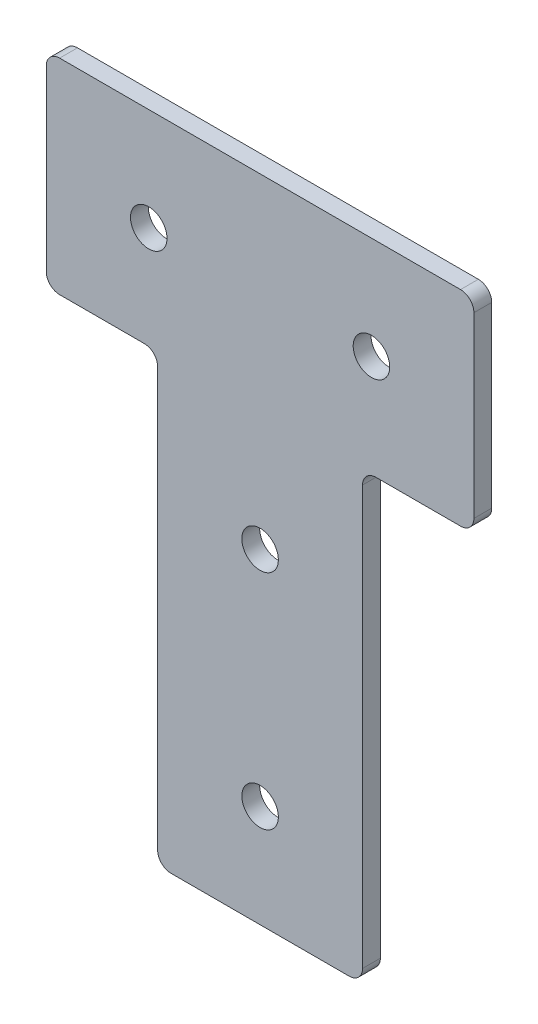
ISO-10303-21;
HEADER;
FILE_DESCRIPTION(('STEP AP214'),'2;1');
FILE_NAME('part.step','',(''),(''),'','','');
FILE_SCHEMA(('AUTOMOTIVE_DESIGN { 1 0 10303 214 1 1 1 1 }'));
ENDSEC;
DATA;
#1=APPLICATION_CONTEXT('core data for automotive mechanical design processes');
#2=APPLICATION_PROTOCOL_DEFINITION('international standard','automotive_design',2000,#1);
#3=PRODUCT_CONTEXT('',#1,'mechanical');
#4=PRODUCT('Part','Part','',(#3));
#5=PRODUCT_RELATED_PRODUCT_CATEGORY('part','',(#4));
#6=PRODUCT_DEFINITION_FORMATION('','',#4);
#7=PRODUCT_DEFINITION_CONTEXT('part definition',#1,'design');
#8=PRODUCT_DEFINITION('design','',#6,#7);
#9=PRODUCT_DEFINITION_SHAPE('','',#8);
#10=(LENGTH_UNIT() NAMED_UNIT(*) SI_UNIT(.MILLI.,.METRE.));
#11=(NAMED_UNIT(*) PLANE_ANGLE_UNIT() SI_UNIT($,.RADIAN.));
#12=(NAMED_UNIT(*) SI_UNIT($,.STERADIAN.) SOLID_ANGLE_UNIT());
#13=UNCERTAINTY_MEASURE_WITH_UNIT(LENGTH_MEASURE(1.E-05),#10,'distance_accuracy_value','');
#14=(GEOMETRIC_REPRESENTATION_CONTEXT(3) GLOBAL_UNCERTAINTY_ASSIGNED_CONTEXT((#13)) GLOBAL_UNIT_ASSIGNED_CONTEXT((#10,
#11,#12)) REPRESENTATION_CONTEXT('',''));
#15=CARTESIAN_POINT('',(0.,0.,0.));
#16=DIRECTION('',(0.,0.,1.));
#17=DIRECTION('',(1.,0.,0.));
#18=AXIS2_PLACEMENT_3D('',#15,#16,#17);
#19=CARTESIAN_POINT('',(0.,0.,4.));
#20=DIRECTION('',(0.,0.,1.));
#21=DIRECTION('',(1.,0.,0.));
#22=AXIS2_PLACEMENT_3D('',#19,#20,#21);
#23=PLANE('',#22);
#24=CARTESIAN_POINT('',(25.0000000000005,-99.9999999999999,4.));
#25=DIRECTION('',(0.,0.,1.));
#26=DIRECTION('',(1.,0.,0.));
#27=AXIS2_PLACEMENT_3D('',#24,#25,#26);
#28=CIRCLE('',#27,4.10000000000001);
#29=CARTESIAN_POINT('',(29.1000000000005,-99.9999999999999,4.));
#30=VERTEX_POINT('',#29);
#31=EDGE_CURVE('E341',#30,#30,#28,.T.);
#32=ORIENTED_EDGE('',*,*,#31,.F.);
#33=EDGE_LOOP('',(#32));
#34=FACE_BOUND('',#33,.T.);
#35=CARTESIAN_POINT('',(0.,0.,4.));
#36=DIRECTION('',(0.,0.,1.));
#37=DIRECTION('',(1.,0.,0.));
#38=AXIS2_PLACEMENT_3D('',#35,#36,#37);
#39=CIRCLE('',#38,4.1);
#40=CARTESIAN_POINT('',(4.1,0.,4.));
#41=VERTEX_POINT('',#40);
#42=EDGE_CURVE('E267',#41,#41,#39,.T.);
#43=ORIENTED_EDGE('',*,*,#42,.F.);
#44=EDGE_LOOP('',(#43));
#45=FACE_BOUND('',#44,.T.);
#46=DIRECTION('',(-1.,0.,0.));
#47=VECTOR('',#46,1.);
#48=CARTESIAN_POINT('',(-23.,23.,4.));
#49=LINE('',#48,#47);
#50=CARTESIAN_POINT('',(70.,23.,4.));
#51=VERTEX_POINT('',#50);
#52=CARTESIAN_POINT('',(-20.,23.,4.));
#53=VERTEX_POINT('',#52);
#54=EDGE_CURVE('E169',#51,#53,#49,.T.);
#55=ORIENTED_EDGE('',*,*,#54,.T.);
#56=CARTESIAN_POINT('',(-20.,20.,4.));
#57=DIRECTION('',(0.,0.,1.));
#58=DIRECTION('',(1.,0.,0.));
#59=AXIS2_PLACEMENT_3D('',#56,#57,#58);
#60=CIRCLE('',#59,3.);
#61=CARTESIAN_POINT('',(-23.,20.,4.));
#62=VERTEX_POINT('',#61);
#63=EDGE_CURVE('E214',#53,#62,#60,.T.);
#64=ORIENTED_EDGE('',*,*,#63,.T.);
#65=DIRECTION('',(0.,-1.,0.));
#66=VECTOR('',#65,1.);
#67=CARTESIAN_POINT('',(-23.,23.,4.));
#68=LINE('',#67,#66);
#69=CARTESIAN_POINT('',(-23.,-20.,4.));
#70=VERTEX_POINT('',#69);
#71=EDGE_CURVE('E168',#62,#70,#68,.T.);
#72=ORIENTED_EDGE('',*,*,#71,.T.);
#73=CARTESIAN_POINT('',(-20.,-20.,4.));
#74=DIRECTION('',(0.,0.,1.));
#75=DIRECTION('',(1.,0.,0.));
#76=AXIS2_PLACEMENT_3D('',#73,#74,#75);
#77=CIRCLE('',#76,3.);
#78=CARTESIAN_POINT('',(-20.,-23.,4.));
#79=VERTEX_POINT('',#78);
#80=EDGE_CURVE('E205',#70,#79,#77,.T.);
#81=ORIENTED_EDGE('',*,*,#80,.T.);
#82=DIRECTION('',(1.,0.,0.));
#83=VECTOR('',#82,1.);
#84=CARTESIAN_POINT('',(-23.,-23.,4.));
#85=LINE('',#84,#83);
#86=CARTESIAN_POINT('',(-1.,-23.,4.));
#87=VERTEX_POINT('',#86);
#88=EDGE_CURVE('E248',#79,#87,#85,.T.);
#89=ORIENTED_EDGE('',*,*,#88,.T.);
#90=CARTESIAN_POINT('',(-1.,-26.,4.));
#91=DIRECTION('',(0.,0.,1.));
#92=DIRECTION('',(1.,0.,0.));
#93=AXIS2_PLACEMENT_3D('',#90,#91,#92);
#94=CIRCLE('',#93,3.);
#95=CARTESIAN_POINT('',(2.,-26.,4.));
#96=VERTEX_POINT('',#95);
#97=EDGE_CURVE('E9',#87,#96,#94,.F.);
#98=ORIENTED_EDGE('',*,*,#97,.T.);
#99=DIRECTION('',(0.,-1.,0.));
#100=VECTOR('',#99,1.);
#101=CARTESIAN_POINT('',(2.,-23.,4.));
#102=LINE('',#101,#100);
#103=CARTESIAN_POINT('',(2.00000000000001,-120.,4.));
#104=VERTEX_POINT('',#103);
#105=EDGE_CURVE('E246',#96,#104,#102,.T.);
#106=ORIENTED_EDGE('',*,*,#105,.T.);
#107=CARTESIAN_POINT('',(5.00000000000001,-120.,4.));
#108=DIRECTION('',(0.,0.,1.));
#109=DIRECTION('',(1.,0.,0.));
#110=AXIS2_PLACEMENT_3D('',#107,#108,#109);
#111=CIRCLE('',#110,3.);
#112=CARTESIAN_POINT('',(5.00000000000001,-123.,4.));
#113=VERTEX_POINT('',#112);
#114=EDGE_CURVE('E210',#104,#113,#111,.T.);
#115=ORIENTED_EDGE('',*,*,#114,.T.);
#116=DIRECTION('',(1.,0.,0.));
#117=VECTOR('',#116,1.);
#118=CARTESIAN_POINT('',(2.00000000000001,-123.,4.));
#119=LINE('',#118,#117);
#120=CARTESIAN_POINT('',(45.,-123.,4.));
#121=VERTEX_POINT('',#120);
#122=EDGE_CURVE('E252',#113,#121,#119,.T.);
#123=ORIENTED_EDGE('',*,*,#122,.T.);
#124=CARTESIAN_POINT('',(45.,-120.,4.));
#125=DIRECTION('',(0.,0.,1.));
#126=DIRECTION('',(1.,0.,0.));
#127=AXIS2_PLACEMENT_3D('',#124,#125,#126);
#128=CIRCLE('',#127,3.);
#129=CARTESIAN_POINT('',(48.,-120.,4.));
#130=VERTEX_POINT('',#129);
#131=EDGE_CURVE('E208',#121,#130,#128,.T.);
#132=ORIENTED_EDGE('',*,*,#131,.T.);
#133=DIRECTION('',(0.,1.,0.));
#134=VECTOR('',#133,1.);
#135=CARTESIAN_POINT('',(48.,-23.,4.));
#136=LINE('',#135,#134);
#137=CARTESIAN_POINT('',(48.,-26.,4.));
#138=VERTEX_POINT('',#137);
#139=EDGE_CURVE('E255',#130,#138,#136,.T.);
#140=ORIENTED_EDGE('',*,*,#139,.T.);
#141=CARTESIAN_POINT('',(51.,-26.,4.));
#142=DIRECTION('',(0.,0.,1.));
#143=DIRECTION('',(1.,0.,0.));
#144=AXIS2_PLACEMENT_3D('',#141,#142,#143);
#145=CIRCLE('',#144,3.);
#146=CARTESIAN_POINT('',(51.,-23.,4.));
#147=VERTEX_POINT('',#146);
#148=EDGE_CURVE('E139',#138,#147,#145,.F.);
#149=ORIENTED_EDGE('',*,*,#148,.T.);
#150=DIRECTION('',(1.,0.,0.));
#151=VECTOR('',#150,1.);
#152=CARTESIAN_POINT('',(48.,-23.,4.));
#153=LINE('',#152,#151);
#154=CARTESIAN_POINT('',(70.,-23.,4.));
#155=VERTEX_POINT('',#154);
#156=EDGE_CURVE('E148',#147,#155,#153,.T.);
#157=ORIENTED_EDGE('',*,*,#156,.T.);
#158=CARTESIAN_POINT('',(70.,-20.,4.));
#159=DIRECTION('',(0.,0.,1.));
#160=DIRECTION('',(1.,0.,0.));
#161=AXIS2_PLACEMENT_3D('',#158,#159,#160);
#162=CIRCLE('',#161,3.);
#163=CARTESIAN_POINT('',(73.,-20.,4.));
#164=VERTEX_POINT('',#163);
#165=EDGE_CURVE('E37',#155,#164,#162,.T.);
#166=ORIENTED_EDGE('',*,*,#165,.T.);
#167=DIRECTION('',(0.,1.,0.));
#168=VECTOR('',#167,1.);
#169=CARTESIAN_POINT('',(73.,23.,4.));
#170=LINE('',#169,#168);
#171=CARTESIAN_POINT('',(73.,20.,4.));
#172=VERTEX_POINT('',#171);
#173=EDGE_CURVE('E263',#164,#172,#170,.T.);
#174=ORIENTED_EDGE('',*,*,#173,.T.);
#175=CARTESIAN_POINT('',(70.,20.,4.));
#176=DIRECTION('',(0.,0.,1.));
#177=DIRECTION('',(1.,0.,0.));
#178=AXIS2_PLACEMENT_3D('',#175,#176,#177);
#179=CIRCLE('',#178,3.);
#180=EDGE_CURVE('E212',#172,#51,#179,.T.);
#181=ORIENTED_EDGE('',*,*,#180,.T.);
#182=EDGE_LOOP('',(#55,#64,#72,#81,#89,#98,#106,#115,#123,#132,#140,#149,#157,#166,#174,#181));
#183=FACE_BOUND('',#182,.T.);
#184=CARTESIAN_POINT('',(50.,0.,4.));
#185=DIRECTION('',(0.,0.,1.));
#186=DIRECTION('',(1.,0.,0.));
#187=AXIS2_PLACEMENT_3D('',#184,#185,#186);
#188=CIRCLE('',#187,4.09999999999999);
#189=CARTESIAN_POINT('',(54.1,0.,4.));
#190=VERTEX_POINT('',#189);
#191=EDGE_CURVE('E335',#190,#190,#188,.T.);
#192=ORIENTED_EDGE('',*,*,#191,.F.);
#193=EDGE_LOOP('',(#192));
#194=FACE_BOUND('',#193,.T.);
#195=CARTESIAN_POINT('',(25.,-50.,4.));
#196=DIRECTION('',(0.,0.,1.));
#197=DIRECTION('',(1.,0.,0.));
#198=AXIS2_PLACEMENT_3D('',#195,#196,#197);
#199=CIRCLE('',#198,4.1);
#200=CARTESIAN_POINT('',(29.1,-50.,4.));
#201=VERTEX_POINT('',#200);
#202=EDGE_CURVE('E347',#201,#201,#199,.T.);
#203=ORIENTED_EDGE('',*,*,#202,.F.);
#204=EDGE_LOOP('',(#203));
#205=FACE_BOUND('',#204,.T.);
#206=ADVANCED_FACE('F15',(#34,#45,#183,#194,#205),#23,.T.);
#207=CARTESIAN_POINT('',(0.,0.,0.));
#208=DIRECTION('',(0.,0.,1.));
#209=DIRECTION('',(1.,0.,0.));
#210=AXIS2_PLACEMENT_3D('',#207,#208,#209);
#211=PLANE('',#210);
#212=DIRECTION('',(0.,-1.,0.));
#213=VECTOR('',#212,1.);
#214=CARTESIAN_POINT('',(-23.,23.,0.));
#215=LINE('',#214,#213);
#216=CARTESIAN_POINT('',(-23.,20.,0.));
#217=VERTEX_POINT('',#216);
#218=CARTESIAN_POINT('',(-23.,-20.,0.));
#219=VERTEX_POINT('',#218);
#220=EDGE_CURVE('E238',#217,#219,#215,.T.);
#221=ORIENTED_EDGE('',*,*,#220,.F.);
#222=CARTESIAN_POINT('',(-20.,20.,0.));
#223=DIRECTION('',(0.,0.,1.));
#224=DIRECTION('',(1.,0.,0.));
#225=AXIS2_PLACEMENT_3D('',#222,#223,#224);
#226=CIRCLE('',#225,3.);
#227=CARTESIAN_POINT('',(-20.,23.,0.));
#228=VERTEX_POINT('',#227);
#229=EDGE_CURVE('E198',#217,#228,#226,.F.);
#230=ORIENTED_EDGE('',*,*,#229,.T.);
#231=DIRECTION('',(-1.,0.,0.));
#232=VECTOR('',#231,1.);
#233=CARTESIAN_POINT('',(-23.,23.,0.));
#234=LINE('',#233,#232);
#235=CARTESIAN_POINT('',(70.,23.,0.));
#236=VERTEX_POINT('',#235);
#237=EDGE_CURVE('E160',#236,#228,#234,.T.);
#238=ORIENTED_EDGE('',*,*,#237,.F.);
#239=CARTESIAN_POINT('',(70.,20.,0.));
#240=DIRECTION('',(0.,0.,1.));
#241=DIRECTION('',(1.,0.,0.));
#242=AXIS2_PLACEMENT_3D('',#239,#240,#241);
#243=CIRCLE('',#242,3.);
#244=CARTESIAN_POINT('',(73.,20.,0.));
#245=VERTEX_POINT('',#244);
#246=EDGE_CURVE('E196',#236,#245,#243,.F.);
#247=ORIENTED_EDGE('',*,*,#246,.T.);
#248=DIRECTION('',(0.,1.,0.));
#249=VECTOR('',#248,1.);
#250=CARTESIAN_POINT('',(73.,23.,0.));
#251=LINE('',#250,#249);
#252=CARTESIAN_POINT('',(73.,-20.,0.));
#253=VERTEX_POINT('',#252);
#254=EDGE_CURVE('E157',#253,#245,#251,.T.);
#255=ORIENTED_EDGE('',*,*,#254,.F.);
#256=CARTESIAN_POINT('',(70.,-20.,0.));
#257=DIRECTION('',(0.,0.,1.));
#258=DIRECTION('',(1.,0.,0.));
#259=AXIS2_PLACEMENT_3D('',#256,#257,#258);
#260=CIRCLE('',#259,3.);
#261=CARTESIAN_POINT('',(70.,-23.,0.));
#262=VERTEX_POINT('',#261);
#263=EDGE_CURVE('E156',#253,#262,#260,.F.);
#264=ORIENTED_EDGE('',*,*,#263,.T.);
#265=DIRECTION('',(1.,0.,0.));
#266=VECTOR('',#265,1.);
#267=CARTESIAN_POINT('',(48.,-23.,0.));
#268=LINE('',#267,#266);
#269=CARTESIAN_POINT('',(51.,-23.,0.));
#270=VERTEX_POINT('',#269);
#271=EDGE_CURVE('E146',#270,#262,#268,.T.);
#272=ORIENTED_EDGE('',*,*,#271,.F.);
#273=CARTESIAN_POINT('',(51.,-26.,0.));
#274=DIRECTION('',(0.,0.,1.));
#275=DIRECTION('',(1.,0.,0.));
#276=AXIS2_PLACEMENT_3D('',#273,#274,#275);
#277=CIRCLE('',#276,3.);
#278=CARTESIAN_POINT('',(48.,-26.,0.));
#279=VERTEX_POINT('',#278);
#280=EDGE_CURVE('E129',#270,#279,#277,.T.);
#281=ORIENTED_EDGE('',*,*,#280,.T.);
#282=DIRECTION('',(0.,1.,0.));
#283=VECTOR('',#282,1.);
#284=CARTESIAN_POINT('',(48.,-23.,0.));
#285=LINE('',#284,#283);
#286=CARTESIAN_POINT('',(48.,-120.,0.));
#287=VERTEX_POINT('',#286);
#288=EDGE_CURVE('E158',#287,#279,#285,.T.);
#289=ORIENTED_EDGE('',*,*,#288,.F.);
#290=CARTESIAN_POINT('',(45.,-120.,0.));
#291=DIRECTION('',(0.,0.,1.));
#292=DIRECTION('',(1.,0.,0.));
#293=AXIS2_PLACEMENT_3D('',#290,#291,#292);
#294=CIRCLE('',#293,3.);
#295=CARTESIAN_POINT('',(45.,-123.,0.));
#296=VERTEX_POINT('',#295);
#297=EDGE_CURVE('E192',#287,#296,#294,.F.);
#298=ORIENTED_EDGE('',*,*,#297,.T.);
#299=DIRECTION('',(1.,0.,0.));
#300=VECTOR('',#299,1.);
#301=CARTESIAN_POINT('',(2.00000000000001,-123.,0.));
#302=LINE('',#301,#300);
#303=CARTESIAN_POINT('',(5.00000000000001,-123.,0.));
#304=VERTEX_POINT('',#303);
#305=EDGE_CURVE('E162',#304,#296,#302,.T.);
#306=ORIENTED_EDGE('',*,*,#305,.F.);
#307=CARTESIAN_POINT('',(5.00000000000001,-120.,0.));
#308=DIRECTION('',(0.,0.,1.));
#309=DIRECTION('',(1.,0.,0.));
#310=AXIS2_PLACEMENT_3D('',#307,#308,#309);
#311=CIRCLE('',#310,3.);
#312=CARTESIAN_POINT('',(2.00000000000001,-120.,0.));
#313=VERTEX_POINT('',#312);
#314=EDGE_CURVE('E194',#304,#313,#311,.F.);
#315=ORIENTED_EDGE('',*,*,#314,.T.);
#316=DIRECTION('',(0.,-1.,0.));
#317=VECTOR('',#316,1.);
#318=CARTESIAN_POINT('',(2.,-23.,0.));
#319=LINE('',#318,#317);
#320=CARTESIAN_POINT('',(2.,-26.,0.));
#321=VERTEX_POINT('',#320);
#322=EDGE_CURVE('E229',#321,#313,#319,.T.);
#323=ORIENTED_EDGE('',*,*,#322,.F.);
#324=CARTESIAN_POINT('',(-1.,-26.,0.));
#325=DIRECTION('',(0.,0.,1.));
#326=DIRECTION('',(1.,0.,0.));
#327=AXIS2_PLACEMENT_3D('',#324,#325,#326);
#328=CIRCLE('',#327,3.);
#329=CARTESIAN_POINT('',(-1.,-23.,0.));
#330=VERTEX_POINT('',#329);
#331=EDGE_CURVE('E23',#321,#330,#328,.T.);
#332=ORIENTED_EDGE('',*,*,#331,.T.);
#333=DIRECTION('',(1.,0.,0.));
#334=VECTOR('',#333,1.);
#335=CARTESIAN_POINT('',(-23.,-23.,0.));
#336=LINE('',#335,#334);
#337=CARTESIAN_POINT('',(-20.,-23.,0.));
#338=VERTEX_POINT('',#337);
#339=EDGE_CURVE('E227',#338,#330,#336,.T.);
#340=ORIENTED_EDGE('',*,*,#339,.F.);
#341=CARTESIAN_POINT('',(-20.,-20.,0.));
#342=DIRECTION('',(0.,0.,1.));
#343=DIRECTION('',(1.,0.,0.));
#344=AXIS2_PLACEMENT_3D('',#341,#342,#343);
#345=CIRCLE('',#344,3.);
#346=EDGE_CURVE('E189',#338,#219,#345,.F.);
#347=ORIENTED_EDGE('',*,*,#346,.T.);
#348=EDGE_LOOP('',(#221,#230,#238,#247,#255,#264,#272,#281,#289,#298,#306,#315,#323,#332,#340,#347));
#349=FACE_BOUND('',#348,.T.);
#350=CARTESIAN_POINT('',(0.,0.,0.));
#351=DIRECTION('',(0.,0.,1.));
#352=DIRECTION('',(1.,0.,0.));
#353=AXIS2_PLACEMENT_3D('',#350,#351,#352);
#354=CIRCLE('',#353,4.1);
#355=CARTESIAN_POINT('',(4.1,0.,0.));
#356=VERTEX_POINT('',#355);
#357=EDGE_CURVE('E332',#356,#356,#354,.T.);
#358=ORIENTED_EDGE('',*,*,#357,.T.);
#359=EDGE_LOOP('',(#358));
#360=FACE_BOUND('',#359,.T.);
#361=CARTESIAN_POINT('',(50.,0.,0.));
#362=DIRECTION('',(0.,0.,1.));
#363=DIRECTION('',(1.,0.,0.));
#364=AXIS2_PLACEMENT_3D('',#361,#362,#363);
#365=CIRCLE('',#364,4.09999999999999);
#366=CARTESIAN_POINT('',(54.1,0.,0.));
#367=VERTEX_POINT('',#366);
#368=EDGE_CURVE('E338',#367,#367,#365,.T.);
#369=ORIENTED_EDGE('',*,*,#368,.T.);
#370=EDGE_LOOP('',(#369));
#371=FACE_BOUND('',#370,.T.);
#372=CARTESIAN_POINT('',(25.0000000000005,-99.9999999999999,0.));
#373=DIRECTION('',(0.,0.,1.));
#374=DIRECTION('',(1.,0.,0.));
#375=AXIS2_PLACEMENT_3D('',#372,#373,#374);
#376=CIRCLE('',#375,4.10000000000001);
#377=CARTESIAN_POINT('',(29.1000000000005,-99.9999999999999,0.));
#378=VERTEX_POINT('',#377);
#379=EDGE_CURVE('E344',#378,#378,#376,.T.);
#380=ORIENTED_EDGE('',*,*,#379,.T.);
#381=EDGE_LOOP('',(#380));
#382=FACE_BOUND('',#381,.T.);
#383=CARTESIAN_POINT('',(25.,-50.,0.));
#384=DIRECTION('',(0.,0.,1.));
#385=DIRECTION('',(1.,0.,0.));
#386=AXIS2_PLACEMENT_3D('',#383,#384,#385);
#387=CIRCLE('',#386,4.1);
#388=CARTESIAN_POINT('',(29.1,-50.,0.));
#389=VERTEX_POINT('',#388);
#390=EDGE_CURVE('E350',#389,#389,#387,.T.);
#391=ORIENTED_EDGE('',*,*,#390,.T.);
#392=EDGE_LOOP('',(#391));
#393=FACE_BOUND('',#392,.T.);
#394=ADVANCED_FACE('F153',(#349,#360,#371,#382,#393),#211,.F.);
#395=CARTESIAN_POINT('',(-23.,23.,4.));
#396=DIRECTION('',(1.,0.,0.));
#397=DIRECTION('',(0.,1.,0.));
#398=AXIS2_PLACEMENT_3D('',#395,#396,#397);
#399=PLANE('',#398);
#400=ORIENTED_EDGE('',*,*,#71,.F.);
#401=DIRECTION('',(0.,0.,-1.));
#402=VECTOR('',#401,1.);
#403=CARTESIAN_POINT('',(-23.,20.,4.));
#404=LINE('',#403,#402);
#405=EDGE_CURVE('E186',#62,#217,#404,.T.);
#406=ORIENTED_EDGE('',*,*,#405,.T.);
#407=ORIENTED_EDGE('',*,*,#220,.T.);
#408=DIRECTION('',(0.,0.,-1.));
#409=VECTOR('',#408,1.);
#410=CARTESIAN_POINT('',(-23.,-20.,4.));
#411=LINE('',#410,#409);
#412=EDGE_CURVE('E184',#219,#70,#411,.F.);
#413=ORIENTED_EDGE('',*,*,#412,.T.);
#414=EDGE_LOOP('',(#400,#406,#407,#413));
#415=FACE_BOUND('',#414,.T.);
#416=ADVANCED_FACE('F299',(#415),#399,.F.);
#417=CARTESIAN_POINT('',(-23.,-23.,4.));
#418=DIRECTION('',(0.,1.,0.));
#419=DIRECTION('',(0.,0.,1.));
#420=AXIS2_PLACEMENT_3D('',#417,#418,#419);
#421=PLANE('',#420);
#422=ORIENTED_EDGE('',*,*,#339,.T.);
#423=DIRECTION('',(0.,0.,-1.));
#424=VECTOR('',#423,1.);
#425=CARTESIAN_POINT('',(-1.,-23.,4.));
#426=LINE('',#425,#424);
#427=EDGE_CURVE('E182',#330,#87,#426,.F.);
#428=ORIENTED_EDGE('',*,*,#427,.T.);
#429=ORIENTED_EDGE('',*,*,#88,.F.);
#430=DIRECTION('',(0.,0.,-1.));
#431=VECTOR('',#430,1.);
#432=CARTESIAN_POINT('',(-20.,-23.,4.));
#433=LINE('',#432,#431);
#434=EDGE_CURVE('E179',#79,#338,#433,.T.);
#435=ORIENTED_EDGE('',*,*,#434,.T.);
#436=EDGE_LOOP('',(#422,#428,#429,#435));
#437=FACE_BOUND('',#436,.T.);
#438=ADVANCED_FACE('F234',(#437),#421,.F.);
#439=CARTESIAN_POINT('',(2.,-23.,4.));
#440=DIRECTION('',(1.,0.,0.));
#441=DIRECTION('',(0.,1.,0.));
#442=AXIS2_PLACEMENT_3D('',#439,#440,#441);
#443=PLANE('',#442);
#444=ORIENTED_EDGE('',*,*,#105,.F.);
#445=DIRECTION('',(0.,0.,-1.));
#446=VECTOR('',#445,1.);
#447=CARTESIAN_POINT('',(2.,-26.,0.));
#448=LINE('',#447,#446);
#449=EDGE_CURVE('E176',#96,#321,#448,.T.);
#450=ORIENTED_EDGE('',*,*,#449,.T.);
#451=ORIENTED_EDGE('',*,*,#322,.T.);
#452=DIRECTION('',(0.,0.,-1.));
#453=VECTOR('',#452,1.);
#454=CARTESIAN_POINT('',(2.00000000000001,-120.,4.));
#455=LINE('',#454,#453);
#456=EDGE_CURVE('E174',#313,#104,#455,.F.);
#457=ORIENTED_EDGE('',*,*,#456,.T.);
#458=EDGE_LOOP('',(#444,#450,#451,#457));
#459=FACE_BOUND('',#458,.T.);
#460=ADVANCED_FACE('F250',(#459),#443,.F.);
#461=CARTESIAN_POINT('',(2.00000000000001,-123.,4.));
#462=DIRECTION('',(0.,1.,0.));
#463=DIRECTION('',(0.,0.,1.));
#464=AXIS2_PLACEMENT_3D('',#461,#462,#463);
#465=PLANE('',#464);
#466=ORIENTED_EDGE('',*,*,#122,.F.);
#467=DIRECTION('',(0.,0.,-1.));
#468=VECTOR('',#467,1.);
#469=CARTESIAN_POINT('',(5.00000000000001,-123.,4.));
#470=LINE('',#469,#468);
#471=EDGE_CURVE('E140',#113,#304,#470,.T.);
#472=ORIENTED_EDGE('',*,*,#471,.T.);
#473=ORIENTED_EDGE('',*,*,#305,.T.);
#474=DIRECTION('',(0.,0.,-1.));
#475=VECTOR('',#474,1.);
#476=CARTESIAN_POINT('',(45.,-123.,4.));
#477=LINE('',#476,#475);
#478=EDGE_CURVE('E220',#296,#121,#477,.F.);
#479=ORIENTED_EDGE('',*,*,#478,.T.);
#480=EDGE_LOOP('',(#466,#472,#473,#479));
#481=FACE_BOUND('',#480,.T.);
#482=ADVANCED_FACE('F274',(#481),#465,.F.);
#483=CARTESIAN_POINT('',(48.,-23.,4.));
#484=DIRECTION('',(-1.,0.,0.));
#485=DIRECTION('',(0.,-1.,0.));
#486=AXIS2_PLACEMENT_3D('',#483,#484,#485);
#487=PLANE('',#486);
#488=ORIENTED_EDGE('',*,*,#288,.T.);
#489=DIRECTION('',(0.,0.,-1.));
#490=VECTOR('',#489,1.);
#491=CARTESIAN_POINT('',(48.,-26.,4.));
#492=LINE('',#491,#490);
#493=EDGE_CURVE('E134',#279,#138,#492,.F.);
#494=ORIENTED_EDGE('',*,*,#493,.T.);
#495=ORIENTED_EDGE('',*,*,#139,.F.);
#496=DIRECTION('',(0.,0.,-1.));
#497=VECTOR('',#496,1.);
#498=CARTESIAN_POINT('',(48.,-120.,4.));
#499=LINE('',#498,#497);
#500=EDGE_CURVE('E149',#130,#287,#499,.T.);
#501=ORIENTED_EDGE('',*,*,#500,.T.);
#502=EDGE_LOOP('',(#488,#494,#495,#501));
#503=FACE_BOUND('',#502,.T.);
#504=ADVANCED_FACE('F282',(#503),#487,.F.);
#505=CARTESIAN_POINT('',(48.,-23.,4.));
#506=DIRECTION('',(0.,1.,0.));
#507=DIRECTION('',(-1.,0.,0.));
#508=AXIS2_PLACEMENT_3D('',#505,#506,#507);
#509=PLANE('',#508);
#510=ORIENTED_EDGE('',*,*,#156,.F.);
#511=DIRECTION('',(0.,0.,-1.));
#512=VECTOR('',#511,1.);
#513=CARTESIAN_POINT('',(51.,-23.,0.));
#514=LINE('',#513,#512);
#515=EDGE_CURVE('E133',#147,#270,#514,.T.);
#516=ORIENTED_EDGE('',*,*,#515,.T.);
#517=ORIENTED_EDGE('',*,*,#271,.T.);
#518=DIRECTION('',(0.,0.,-1.));
#519=VECTOR('',#518,1.);
#520=CARTESIAN_POINT('',(70.,-23.,4.));
#521=LINE('',#520,#519);
#522=EDGE_CURVE('E150',#262,#155,#521,.F.);
#523=ORIENTED_EDGE('',*,*,#522,.T.);
#524=EDGE_LOOP('',(#510,#516,#517,#523));
#525=FACE_BOUND('',#524,.T.);
#526=ADVANCED_FACE('F145',(#525),#509,.F.);
#527=CARTESIAN_POINT('',(73.,23.,4.));
#528=DIRECTION('',(-1.,0.,0.));
#529=DIRECTION('',(0.,0.,1.));
#530=AXIS2_PLACEMENT_3D('',#527,#528,#529);
#531=PLANE('',#530);
#532=ORIENTED_EDGE('',*,*,#254,.T.);
#533=DIRECTION('',(0.,0.,-1.));
#534=VECTOR('',#533,1.);
#535=CARTESIAN_POINT('',(73.,20.,4.));
#536=LINE('',#535,#534);
#537=EDGE_CURVE('E30',#245,#172,#536,.F.);
#538=ORIENTED_EDGE('',*,*,#537,.T.);
#539=ORIENTED_EDGE('',*,*,#173,.F.);
#540=DIRECTION('',(0.,0.,-1.));
#541=VECTOR('',#540,1.);
#542=CARTESIAN_POINT('',(73.,-20.,4.));
#543=LINE('',#542,#541);
#544=EDGE_CURVE('E216',#164,#253,#543,.T.);
#545=ORIENTED_EDGE('',*,*,#544,.T.);
#546=EDGE_LOOP('',(#532,#538,#539,#545));
#547=FACE_BOUND('',#546,.T.);
#548=ADVANCED_FACE('F290',(#547),#531,.F.);
#549=CARTESIAN_POINT('',(-23.,23.,4.));
#550=DIRECTION('',(0.,-1.,0.));
#551=DIRECTION('',(1.,0.,0.));
#552=AXIS2_PLACEMENT_3D('',#549,#550,#551);
#553=PLANE('',#552);
#554=ORIENTED_EDGE('',*,*,#237,.T.);
#555=DIRECTION('',(0.,0.,-1.));
#556=VECTOR('',#555,1.);
#557=CARTESIAN_POINT('',(-20.,23.,4.));
#558=LINE('',#557,#556);
#559=EDGE_CURVE('E203',#228,#53,#558,.F.);
#560=ORIENTED_EDGE('',*,*,#559,.T.);
#561=ORIENTED_EDGE('',*,*,#54,.F.);
#562=DIRECTION('',(0.,0.,-1.));
#563=VECTOR('',#562,1.);
#564=CARTESIAN_POINT('',(70.,23.,4.));
#565=LINE('',#564,#563);
#566=EDGE_CURVE('E200',#51,#236,#565,.T.);
#567=ORIENTED_EDGE('',*,*,#566,.T.);
#568=EDGE_LOOP('',(#554,#560,#561,#567));
#569=FACE_BOUND('',#568,.T.);
#570=ADVANCED_FACE('F307',(#569),#553,.F.);
#571=CARTESIAN_POINT('',(0.,0.,4.));
#572=DIRECTION('',(0.,0.,-1.));
#573=DIRECTION('',(-1.,0.,0.));
#574=AXIS2_PLACEMENT_3D('',#571,#572,#573);
#575=CYLINDRICAL_SURFACE('',#574,4.1);
#576=ORIENTED_EDGE('',*,*,#42,.T.);
#577=EDGE_LOOP('',(#576));
#578=FACE_BOUND('',#577,.T.);
#579=ORIENTED_EDGE('',*,*,#357,.F.);
#580=EDGE_LOOP('',(#579));
#581=FACE_BOUND('',#580,.T.);
#582=ADVANCED_FACE('F304',(#578,#581),#575,.F.);
#583=CARTESIAN_POINT('',(50.,0.,4.));
#584=DIRECTION('',(0.,0.,-1.));
#585=DIRECTION('',(-1.,0.,0.));
#586=AXIS2_PLACEMENT_3D('',#583,#584,#585);
#587=CYLINDRICAL_SURFACE('',#586,4.09999999999999);
#588=ORIENTED_EDGE('',*,*,#191,.T.);
#589=EDGE_LOOP('',(#588));
#590=FACE_BOUND('',#589,.T.);
#591=ORIENTED_EDGE('',*,*,#368,.F.);
#592=EDGE_LOOP('',(#591));
#593=FACE_BOUND('',#592,.T.);
#594=ADVANCED_FACE('F369',(#590,#593),#587,.F.);
#595=CARTESIAN_POINT('',(25.0000000000005,-99.9999999999999,4.));
#596=DIRECTION('',(0.,0.,-1.));
#597=DIRECTION('',(-1.,0.,0.));
#598=AXIS2_PLACEMENT_3D('',#595,#596,#597);
#599=CYLINDRICAL_SURFACE('',#598,4.10000000000001);
#600=ORIENTED_EDGE('',*,*,#31,.T.);
#601=EDGE_LOOP('',(#600));
#602=FACE_BOUND('',#601,.T.);
#603=ORIENTED_EDGE('',*,*,#379,.F.);
#604=EDGE_LOOP('',(#603));
#605=FACE_BOUND('',#604,.T.);
#606=ADVANCED_FACE('F360',(#602,#605),#599,.F.);
#607=CARTESIAN_POINT('',(25.,-50.,4.));
#608=DIRECTION('',(0.,0.,-1.));
#609=DIRECTION('',(-1.,0.,0.));
#610=AXIS2_PLACEMENT_3D('',#607,#608,#609);
#611=CYLINDRICAL_SURFACE('',#610,4.1);
#612=ORIENTED_EDGE('',*,*,#202,.T.);
#613=EDGE_LOOP('',(#612));
#614=FACE_BOUND('',#613,.T.);
#615=ORIENTED_EDGE('',*,*,#390,.F.);
#616=EDGE_LOOP('',(#615));
#617=FACE_BOUND('',#616,.T.);
#618=ADVANCED_FACE('F356',(#614,#617),#611,.F.);
#619=CARTESIAN_POINT('',(51.,-26.,4.));
#620=DIRECTION('',(0.,0.,1.));
#621=DIRECTION('',(1.,0.,0.));
#622=AXIS2_PLACEMENT_3D('',#619,#620,#621);
#623=CYLINDRICAL_SURFACE('',#622,3.);
#624=ORIENTED_EDGE('',*,*,#148,.F.);
#625=ORIENTED_EDGE('',*,*,#493,.F.);
#626=ORIENTED_EDGE('',*,*,#280,.F.);
#627=ORIENTED_EDGE('',*,*,#515,.F.);
#628=EDGE_LOOP('',(#624,#625,#626,#627));
#629=FACE_BOUND('',#628,.T.);
#630=ADVANCED_FACE('F132',(#629),#623,.F.);
#631=CARTESIAN_POINT('',(-1.,-26.,4.));
#632=DIRECTION('',(0.,0.,1.));
#633=DIRECTION('',(1.,0.,0.));
#634=AXIS2_PLACEMENT_3D('',#631,#632,#633);
#635=CYLINDRICAL_SURFACE('',#634,3.);
#636=ORIENTED_EDGE('',*,*,#97,.F.);
#637=ORIENTED_EDGE('',*,*,#427,.F.);
#638=ORIENTED_EDGE('',*,*,#331,.F.);
#639=ORIENTED_EDGE('',*,*,#449,.F.);
#640=EDGE_LOOP('',(#636,#637,#638,#639));
#641=FACE_BOUND('',#640,.T.);
#642=ADVANCED_FACE('F241',(#641),#635,.F.);
#643=CARTESIAN_POINT('',(-20.,20.,4.));
#644=DIRECTION('',(0.,0.,-1.));
#645=DIRECTION('',(-1.,0.,0.));
#646=AXIS2_PLACEMENT_3D('',#643,#644,#645);
#647=CYLINDRICAL_SURFACE('',#646,3.);
#648=ORIENTED_EDGE('',*,*,#63,.F.);
#649=ORIENTED_EDGE('',*,*,#559,.F.);
#650=ORIENTED_EDGE('',*,*,#229,.F.);
#651=ORIENTED_EDGE('',*,*,#405,.F.);
#652=EDGE_LOOP('',(#648,#649,#650,#651));
#653=FACE_BOUND('',#652,.T.);
#654=ADVANCED_FACE('F324',(#653),#647,.T.);
#655=CARTESIAN_POINT('',(70.,20.,4.));
#656=DIRECTION('',(0.,0.,-1.));
#657=DIRECTION('',(-1.,0.,0.));
#658=AXIS2_PLACEMENT_3D('',#655,#656,#657);
#659=CYLINDRICAL_SURFACE('',#658,3.);
#660=ORIENTED_EDGE('',*,*,#180,.F.);
#661=ORIENTED_EDGE('',*,*,#537,.F.);
#662=ORIENTED_EDGE('',*,*,#246,.F.);
#663=ORIENTED_EDGE('',*,*,#566,.F.);
#664=EDGE_LOOP('',(#660,#661,#662,#663));
#665=FACE_BOUND('',#664,.T.);
#666=ADVANCED_FACE('F317',(#665),#659,.T.);
#667=CARTESIAN_POINT('',(5.00000000000001,-120.,4.));
#668=DIRECTION('',(0.,0.,-1.));
#669=DIRECTION('',(-1.,0.,0.));
#670=AXIS2_PLACEMENT_3D('',#667,#668,#669);
#671=CYLINDRICAL_SURFACE('',#670,3.);
#672=ORIENTED_EDGE('',*,*,#114,.F.);
#673=ORIENTED_EDGE('',*,*,#456,.F.);
#674=ORIENTED_EDGE('',*,*,#314,.F.);
#675=ORIENTED_EDGE('',*,*,#471,.F.);
#676=EDGE_LOOP('',(#672,#673,#674,#675));
#677=FACE_BOUND('',#676,.T.);
#678=ADVANCED_FACE('F481',(#677),#671,.T.);
#679=CARTESIAN_POINT('',(45.,-120.,4.));
#680=DIRECTION('',(0.,0.,-1.));
#681=DIRECTION('',(-1.,0.,0.));
#682=AXIS2_PLACEMENT_3D('',#679,#680,#681);
#683=CYLINDRICAL_SURFACE('',#682,3.);
#684=ORIENTED_EDGE('',*,*,#131,.F.);
#685=ORIENTED_EDGE('',*,*,#478,.F.);
#686=ORIENTED_EDGE('',*,*,#297,.F.);
#687=ORIENTED_EDGE('',*,*,#500,.F.);
#688=EDGE_LOOP('',(#684,#685,#686,#687));
#689=FACE_BOUND('',#688,.T.);
#690=ADVANCED_FACE('F278',(#689),#683,.T.);
#691=CARTESIAN_POINT('',(70.,-20.,4.));
#692=DIRECTION('',(0.,0.,-1.));
#693=DIRECTION('',(-1.,0.,0.));
#694=AXIS2_PLACEMENT_3D('',#691,#692,#693);
#695=CYLINDRICAL_SURFACE('',#694,3.);
#696=ORIENTED_EDGE('',*,*,#165,.F.);
#697=ORIENTED_EDGE('',*,*,#522,.F.);
#698=ORIENTED_EDGE('',*,*,#263,.F.);
#699=ORIENTED_EDGE('',*,*,#544,.F.);
#700=EDGE_LOOP('',(#696,#697,#698,#699));
#701=FACE_BOUND('',#700,.T.);
#702=ADVANCED_FACE('F466',(#701),#695,.T.);
#703=CARTESIAN_POINT('',(-20.,-20.,4.));
#704=DIRECTION('',(0.,0.,-1.));
#705=DIRECTION('',(-1.,0.,0.));
#706=AXIS2_PLACEMENT_3D('',#703,#704,#705);
#707=CYLINDRICAL_SURFACE('',#706,3.);
#708=ORIENTED_EDGE('',*,*,#80,.F.);
#709=ORIENTED_EDGE('',*,*,#412,.F.);
#710=ORIENTED_EDGE('',*,*,#346,.F.);
#711=ORIENTED_EDGE('',*,*,#434,.F.);
#712=EDGE_LOOP('',(#708,#709,#710,#711));
#713=FACE_BOUND('',#712,.T.);
#714=ADVANCED_FACE('F17',(#713),#707,.T.);
#715=CLOSED_SHELL('',(#206,#394,#416,#438,#460,#482,#504,#526,#548,#570,#582,#594,#606,#618,
#630,#642,#654,#666,#678,#690,#702,#714));
#716=MANIFOLD_SOLID_BREP('B1',#715);
#717=ADVANCED_BREP_SHAPE_REPRESENTATION('',(#18,#716),#14);
#718=SHAPE_DEFINITION_REPRESENTATION(#9,#717);
ENDSEC;
END-ISO-10303-21;
